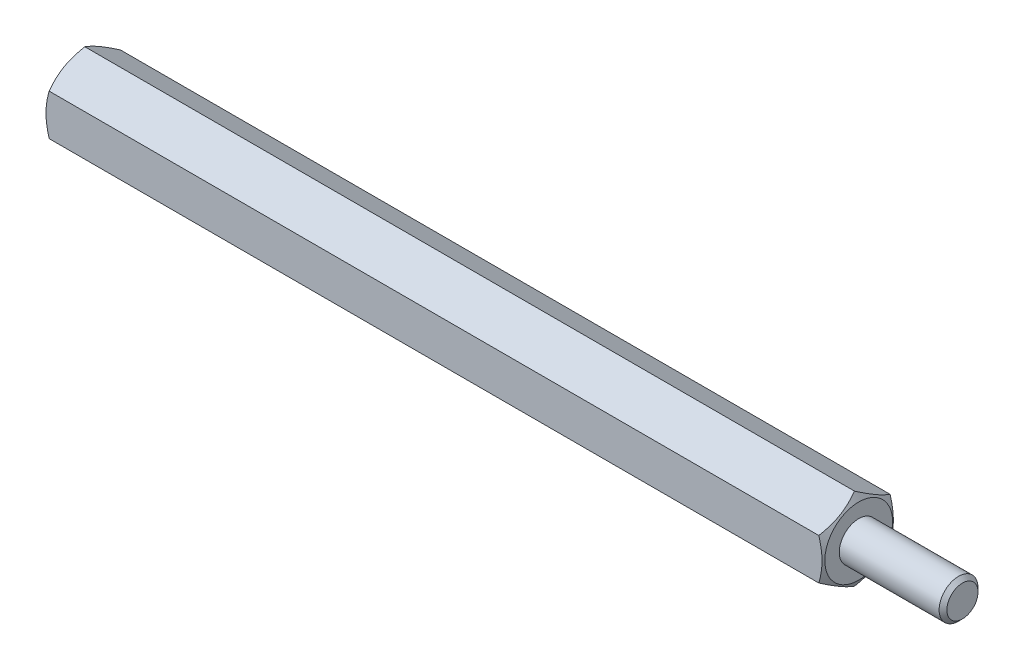
ISO-10303-21;
HEADER;
FILE_DESCRIPTION(('STEP AP214'),'2;1');
FILE_NAME('part.step','',(''),(''),'','','');
FILE_SCHEMA(('AUTOMOTIVE_DESIGN { 1 0 10303 214 1 1 1 1 }'));
ENDSEC;
DATA;
#1=APPLICATION_CONTEXT('core data for automotive mechanical design processes');
#2=APPLICATION_PROTOCOL_DEFINITION('international standard','automotive_design',2000,#1);
#3=PRODUCT_CONTEXT('',#1,'mechanical');
#4=PRODUCT('Part','Part','',(#3));
#5=PRODUCT_RELATED_PRODUCT_CATEGORY('part','',(#4));
#6=PRODUCT_DEFINITION_FORMATION('','',#4);
#7=PRODUCT_DEFINITION_CONTEXT('part definition',#1,'design');
#8=PRODUCT_DEFINITION('design','',#6,#7);
#9=PRODUCT_DEFINITION_SHAPE('','',#8);
#10=(LENGTH_UNIT() NAMED_UNIT(*) SI_UNIT(.MILLI.,.METRE.));
#11=(NAMED_UNIT(*) PLANE_ANGLE_UNIT() SI_UNIT($,.RADIAN.));
#12=(NAMED_UNIT(*) SI_UNIT($,.STERADIAN.) SOLID_ANGLE_UNIT());
#13=UNCERTAINTY_MEASURE_WITH_UNIT(LENGTH_MEASURE(1.E-05),#10,'distance_accuracy_value','');
#14=(GEOMETRIC_REPRESENTATION_CONTEXT(3) GLOBAL_UNCERTAINTY_ASSIGNED_CONTEXT((#13)) GLOBAL_UNIT_ASSIGNED_CONTEXT((#10,
#11,#12)) REPRESENTATION_CONTEXT('',''));
#15=CARTESIAN_POINT('',(0.,0.,0.));
#16=DIRECTION('',(0.,0.,1.));
#17=DIRECTION('',(1.,0.,0.));
#18=AXIS2_PLACEMENT_3D('',#15,#16,#17);
#19=CARTESIAN_POINT('',(60.,0.,0.));
#20=DIRECTION('',(1.,0.,0.));
#21=DIRECTION('',(0.,0.,-1.));
#22=AXIS2_PLACEMENT_3D('',#19,#20,#21);
#23=PLANE('',#22);
#24=CARTESIAN_POINT('',(60.,0.,0.));
#25=DIRECTION('',(1.,0.,0.));
#26=DIRECTION('',(0.,0.,-1.));
#27=AXIS2_PLACEMENT_3D('',#24,#25,#26);
#28=CIRCLE('',#27,1.5);
#29=CARTESIAN_POINT('',(60.,0.,-1.5));
#30=VERTEX_POINT('',#29);
#31=EDGE_CURVE('E120',#30,#30,#28,.T.);
#32=ORIENTED_EDGE('',*,*,#31,.F.);
#33=EDGE_LOOP('',(#32));
#34=FACE_BOUND('',#33,.T.);
#35=CARTESIAN_POINT('',(60.,0.,0.));
#36=DIRECTION('',(1.,0.,0.));
#37=DIRECTION('',(0.,0.,-1.));
#38=AXIS2_PLACEMENT_3D('',#35,#36,#37);
#39=CIRCLE('',#38,2.61250000000001);
#40=CARTESIAN_POINT('',(60.,0.,-2.61250000000001));
#41=VERTEX_POINT('',#40);
#42=EDGE_CURVE('E252',#41,#41,#39,.T.);
#43=ORIENTED_EDGE('',*,*,#42,.T.);
#44=EDGE_LOOP('',(#43));
#45=FACE_BOUND('',#44,.T.);
#46=ADVANCED_FACE('F33',(#34,#45),#23,.T.);
#47=CARTESIAN_POINT('',(68.,0.,0.));
#48=DIRECTION('',(-1.,0.,0.));
#49=DIRECTION('',(0.,0.,1.));
#50=AXIS2_PLACEMENT_3D('',#47,#48,#49);
#51=CYLINDRICAL_SURFACE('',#50,1.5);
#52=CARTESIAN_POINT('',(67.7,0.,0.));
#53=DIRECTION('',(1.,0.,0.));
#54=DIRECTION('',(0.,0.,-1.));
#55=AXIS2_PLACEMENT_3D('',#52,#53,#54);
#56=CIRCLE('',#55,1.5);
#57=CARTESIAN_POINT('',(67.7,0.,-1.5));
#58=VERTEX_POINT('',#57);
#59=EDGE_CURVE('E11',#58,#58,#56,.F.);
#60=ORIENTED_EDGE('',*,*,#59,.T.);
#61=EDGE_LOOP('',(#60));
#62=FACE_BOUND('',#61,.T.);
#63=ORIENTED_EDGE('',*,*,#31,.T.);
#64=EDGE_LOOP('',(#63));
#65=FACE_BOUND('',#64,.T.);
#66=ADVANCED_FACE('F229',(#62,#65),#51,.T.);
#67=CARTESIAN_POINT('',(68.,0.,0.));
#68=DIRECTION('',(1.,0.,0.));
#69=DIRECTION('',(0.,0.,-1.));
#70=AXIS2_PLACEMENT_3D('',#67,#68,#69);
#71=PLANE('',#70);
#72=CARTESIAN_POINT('',(68.,0.,0.));
#73=DIRECTION('',(1.,0.,0.));
#74=DIRECTION('',(0.,0.,-1.));
#75=AXIS2_PLACEMENT_3D('',#72,#73,#74);
#76=CIRCLE('',#75,1.20000000000001);
#77=CARTESIAN_POINT('',(68.,0.,-1.20000000000001));
#78=VERTEX_POINT('',#77);
#79=EDGE_CURVE('E41',#78,#78,#76,.T.);
#80=ORIENTED_EDGE('',*,*,#79,.T.);
#81=EDGE_LOOP('',(#80));
#82=FACE_BOUND('',#81,.T.);
#83=ADVANCED_FACE('F152',(#82),#71,.T.);
#84=CARTESIAN_POINT('',(60.,0.,0.));
#85=DIRECTION('',(-1.,0.,0.));
#86=DIRECTION('',(0.,0.,1.));
#87=AXIS2_PLACEMENT_3D('',#84,#85,#86);
#88=CONICAL_SURFACE('',#87,2.61250000000001,1.0471975511966);
#89=ORIENTED_EDGE('',*,*,#42,.F.);
#90=EDGE_LOOP('',(#89));
#91=FACE_BOUND('',#90,.T.);
#92=CARTESIAN_POINT('',(59.6749275746217,1.58759777021764,-2.7502));
#93=CARTESIAN_POINT('',(59.7152266757372,1.65737010029699,-2.62935077934009));
#94=CARTESIAN_POINT('',(59.7518774353888,1.72774469983534,-2.50745839737736));
#95=CARTESIAN_POINT('',(59.8158521550166,1.86971254687003,-2.2615628732721));
#96=CARTESIAN_POINT('',(59.8431534823119,1.94130831721583,-2.13755536142614));
#97=CARTESIAN_POINT('',(59.8856525926923,2.08361254889599,-1.89107720202405));
#98=CARTESIAN_POINT('',(59.901133219364,2.15429911309864,-1.76864448141258));
#99=CARTESIAN_POINT('',(59.9196149406165,2.29600490065923,-1.52320285763108));
#100=CARTESIAN_POINT('',(59.9226313385238,2.36702360884404,-1.40019484676708));
#101=CARTESIAN_POINT('',(59.9163611925579,2.49972966594897,-1.1703412133892));
#102=CARTESIAN_POINT('',(59.9086141837097,2.56143686540073,-1.06346120874597));
#103=CARTESIAN_POINT('',(59.8840591569221,2.68444923614047,-0.850397532665245));
#104=CARTESIAN_POINT('',(59.8672427483359,2.74575398185008,-0.744214598351106));
#105=CARTESIAN_POINT('',(59.8252024156405,2.86902004703207,-0.530711510606811));
#106=CARTESIAN_POINT('',(59.7998002572992,2.93096576264319,-0.42341838385714));
#107=CARTESIAN_POINT('',(59.7421471121464,3.05393320806134,-0.210432520715945));
#108=CARTESIAN_POINT('',(59.7099096746875,3.11495651365995,-0.104737054973344));
#109=CARTESIAN_POINT('',(59.6749275746217,3.17554195059678,0.000200000000003415));
#110=B_SPLINE_CURVE_WITH_KNOTS('',3,(#92,#93,#94,#95,#96,#97,#98,#99,#100,#101,#102,#103,#104,
#105,#106,#107,#108,#109),.UNSPECIFIED.,.F.,.F.,(4,2,2,2,2,2,2,2,4),(0.,0.435912828725889,
0.872873557116332,1.29901931904672,1.72464171213574,2.09526089052938,2.46622354066374,
2.84541551798557,3.22386274754524),.UNSPECIFIED.);
#111=CARTESIAN_POINT('',(59.6749942449246,1.58771324027148,-2.75));
#112=VERTEX_POINT('',#111);
#113=CARTESIAN_POINT('',(59.6749942449246,3.17542648054294,0.));
#114=VERTEX_POINT('',#113);
#115=EDGE_CURVE('E131',#112,#114,#110,.T.);
#116=ORIENTED_EDGE('',*,*,#115,.T.);
#117=CARTESIAN_POINT('',(59.6749275746217,3.17554195059678,-0.000199999999996035));
#118=CARTESIAN_POINT('',(59.7152266757372,3.10576962051743,0.120649220659911));
#119=CARTESIAN_POINT('',(59.7518774353888,3.03539502097908,0.242541602622638));
#120=CARTESIAN_POINT('',(59.8158521550166,2.89342717394439,0.488437126727896));
#121=CARTESIAN_POINT('',(59.8431534823119,2.82183140359859,0.612444638573859));
#122=CARTESIAN_POINT('',(59.8856525926923,2.67952717191843,0.858922797975947));
#123=CARTESIAN_POINT('',(59.901133219364,2.60884060771577,0.981355518587421));
#124=CARTESIAN_POINT('',(59.9196149406165,2.46713482015519,1.22679714236892));
#125=CARTESIAN_POINT('',(59.9226313385238,2.39611611197038,1.34980515323292));
#126=CARTESIAN_POINT('',(59.9163611925579,2.26341005486544,1.5796587866108));
#127=CARTESIAN_POINT('',(59.9086141837097,2.20170285541369,1.68653879125403));
#128=CARTESIAN_POINT('',(59.8840591569221,2.07869048467395,1.89960246733475));
#129=CARTESIAN_POINT('',(59.8672427483359,2.01738573896434,2.00578540164889));
#130=CARTESIAN_POINT('',(59.8252024156405,1.89411967378235,2.21928848939319));
#131=CARTESIAN_POINT('',(59.7998002572992,1.83217395817123,2.32658161614286));
#132=CARTESIAN_POINT('',(59.7421471121464,1.70920651275308,2.53956747928405));
#133=CARTESIAN_POINT('',(59.7099096746875,1.64818320715446,2.64526294502665));
#134=CARTESIAN_POINT('',(59.6749275746217,1.58759777021764,2.7502));
#135=B_SPLINE_CURVE_WITH_KNOTS('',3,(#117,#118,#119,#120,#121,#122,#123,#124,#125,#126,#127,
#128,#129,#130,#131,#132,#133,#134),.UNSPECIFIED.,.F.,.F.,(4,2,2,2,2,2,2,2,4),(0.,
0.435912828725887,0.872873557116332,1.29901931904672,1.72464171213574,2.09526089052938,
2.46622354066374,2.84541551798557,3.22386274754524),.UNSPECIFIED.);
#136=CARTESIAN_POINT('',(59.6749942449246,1.58771324027147,2.75));
#137=VERTEX_POINT('',#136);
#138=EDGE_CURVE('E139',#114,#137,#135,.T.);
#139=ORIENTED_EDGE('',*,*,#138,.T.);
#140=CARTESIAN_POINT('',(58.5576319326316,-4.30782014241011,2.75));
#141=CARTESIAN_POINT('',(58.6162836095867,-4.18726531654581,2.75));
#142=CARTESIAN_POINT('',(58.6743849240465,-4.06643816910979,2.75));
#143=CARTESIAN_POINT('',(58.7891778669407,-3.8240944166195,2.75));
#144=CARTESIAN_POINT('',(58.8458692806511,-3.70257770996671,2.75));
#145=CARTESIAN_POINT('',(58.9578090560797,-3.458105356063,2.75));
#146=CARTESIAN_POINT('',(59.0130482619427,-3.33514550230565,2.75));
#147=CARTESIAN_POINT('',(59.1213204698911,-3.08826186435015,2.75));
#148=CARTESIAN_POINT('',(59.1743535739049,-2.96433812500113,2.75));
#149=CARTESIAN_POINT('',(59.2792921273943,-2.7113269404381,2.75));
#150=CARTESIAN_POINT('',(59.3311065567683,-2.58220154142924,2.75));
#151=CARTESIAN_POINT('',(59.430916990516,-2.32245648864391,2.75));
#152=CARTESIAN_POINT('',(59.4789125727853,-2.19183667150655,2.75));
#153=CARTESIAN_POINT('',(59.5698579692354,-1.92912498594656,2.75));
#154=CARTESIAN_POINT('',(59.6128175918125,-1.79703654670007,2.75));
#155=CARTESIAN_POINT('',(59.692341778118,-1.53096629694382,2.75));
#156=CARTESIAN_POINT('',(59.7289083094407,-1.39698508274037,2.75));
#157=CARTESIAN_POINT('',(59.7937438460925,-1.12772708047234,2.75));
#158=CARTESIAN_POINT('',(59.8220547897378,-0.992460577616634,2.75));
#159=CARTESIAN_POINT('',(59.8687813176856,-0.720203153927686,2.75));
#160=CARTESIAN_POINT('',(59.8871980675804,-0.583212438163359,2.75));
#161=CARTESIAN_POINT('',(59.9124291314624,-0.309989978008801,2.75));
#162=CARTESIAN_POINT('',(59.9193954911205,-0.17377262999625,2.75));
#163=CARTESIAN_POINT('',(59.9215379629552,0.0987726794769199,2.75));
#164=CARTESIAN_POINT('',(59.9167134971984,0.235100646032144,2.75));
#165=CARTESIAN_POINT('',(59.8989680753535,0.465158037199999,2.75));
#166=CARTESIAN_POINT('',(59.8889841108657,0.559128814459648,2.75));
#167=CARTESIAN_POINT('',(59.8640111201075,0.746408748148826,2.75));
#168=CARTESIAN_POINT('',(59.8490213815566,0.839717808490767,2.75));
#169=CARTESIAN_POINT('',(59.7973222369876,1.11853931619131,2.75));
#170=CARTESIAN_POINT('',(59.7538938441819,1.30282115121641,2.75));
#171=CARTESIAN_POINT('',(59.6782135831305,1.5786792582721,2.75));
#172=CARTESIAN_POINT('',(59.6508277417716,1.67167174830886,2.75));
#173=CARTESIAN_POINT('',(59.5931453490653,1.85669755112827,2.75));
#174=CARTESIAN_POINT('',(59.562850519184,1.94873139590001,2.75));
#175=CARTESIAN_POINT('',(59.4998214739185,2.13194851920639,2.75));
#176=CARTESIAN_POINT('',(59.4670873446708,2.22313182764734,2.75));
#177=CARTESIAN_POINT('',(59.3995759688816,2.40475072200259,2.75));
#178=CARTESIAN_POINT('',(59.3647984472483,2.49518620536279,2.75));
#179=CARTESIAN_POINT('',(59.286074979109,2.69425906745494,2.75));
#180=CARTESIAN_POINT('',(59.2417347386106,2.8027401541903,2.75));
#181=CARTESIAN_POINT('',(59.1510337491748,3.01885617108242,2.75));
#182=CARTESIAN_POINT('',(59.1046729095401,3.12649106300008,2.75));
#183=CARTESIAN_POINT('',(58.9631220023641,3.44835421203613,2.75));
#184=CARTESIAN_POINT('',(58.865478930226,3.66150285378819,2.75));
#185=CARTESIAN_POINT('',(58.6657085844919,4.08582350126589,2.75));
#186=CARTESIAN_POINT('',(58.5635786539451,4.29699424346804,2.75));
#187=CARTESIAN_POINT('',(58.3561807980291,4.71779425640232,2.75));
#188=CARTESIAN_POINT('',(58.2509127618966,4.92742347239814,2.75));
#189=CARTESIAN_POINT('',(58.037845903081,5.34602646409934,2.75));
#190=CARTESIAN_POINT('',(57.9300415771346,5.55499742988841,2.75));
#191=CARTESIAN_POINT('',(57.7127213552635,5.97205161125949,2.75));
#192=CARTESIAN_POINT('',(57.6032054225523,6.18013480763858,2.75));
#193=CARTESIAN_POINT('',(57.2728160121337,6.80319050465919,2.75));
#194=CARTESIAN_POINT('',(57.0500134395911,7.21713914846339,2.75));
#195=CARTESIAN_POINT('',(56.6349320787507,7.98131294129822,2.75));
#196=CARTESIAN_POINT('',(56.443091202704,8.33177707266852,2.75));
#197=CARTESIAN_POINT('',(56.0577699675954,9.03185646098386,2.75));
#198=CARTESIAN_POINT('',(55.8642894185863,9.38147161337288,2.75));
#199=CARTESIAN_POINT('',(55.4770176449484,10.0785196333477,2.75));
#200=CARTESIAN_POINT('',(55.2832315222264,10.425955339249,2.75));
#201=CARTESIAN_POINT('',(54.8948017372515,11.1202888046247,2.75));
#202=CARTESIAN_POINT('',(54.7001581879707,11.4671866272798,2.75));
#203=CARTESIAN_POINT('',(54.5052089419493,11.8139117951099,2.75));
#204=B_SPLINE_CURVE_WITH_KNOTS('',3,(#140,#141,#142,#143,#144,#145,#146,#147,#148,#149,#150,
#151,#152,#153,#154,#155,#156,#157,#158,#159,#160,#161,#162,#163,#164,#165,#166,#167,#168,#169,
#170,#171,#172,#173,#174,#175,#176,#177,#178,#179,#180,#181,#182,#183,#184,#185,#186,#187,#188,
#189,#190,#191,#192,#193,#194,#195,#196,#197,#198,#199,#200,#201,#202,#203),.UNSPECIFIED.,.F.,
.F.,(4,2,2,2,2,2,2,2,2,2,2,2,2,2,2,2,2,2,2,2,2,2,2,2,2,2,2,2,2,2,2,4),(0.,0.402200406174205,
0.804461695776017,1.20883826557492,1.61319613116904,2.03054962807288,2.44794919196405,
2.86452179433192,3.28096596207104,3.69525619374117,4.10949760895259,4.51819266601271,
4.92690775587314,5.21027047572885,5.49367353296155,6.06085418548304,6.35165161864581,
6.64227801348786,6.93289415059065,7.22354950196185,7.57510236122624,7.92667101670863,
8.62993150186773,9.33361419796499,10.0373217608381,10.7427306430188,11.4481547069671,
12.8584292219797,14.0570297519007,15.255771084781,16.4492444189717,17.6425649463424),.UNSPECIFIED.);
#205=CARTESIAN_POINT('',(59.6749942449246,-1.58771324027147,2.75));
#206=VERTEX_POINT('',#205);
#207=EDGE_CURVE('E179',#137,#206,#204,.F.);
#208=ORIENTED_EDGE('',*,*,#207,.T.);
#209=CARTESIAN_POINT('',(59.6749275746217,-1.58759777021763,2.7502));
#210=CARTESIAN_POINT('',(59.7152266757372,-1.65737010029699,2.62935077934009));
#211=CARTESIAN_POINT('',(59.7518774353888,-1.72774469983533,2.50745839737736));
#212=CARTESIAN_POINT('',(59.8158521550166,-1.86971254687003,2.26156287327211));
#213=CARTESIAN_POINT('',(59.8431534823119,-1.94130831721583,2.13755536142614));
#214=CARTESIAN_POINT('',(59.8856525926923,-2.08361254889599,1.89107720202405));
#215=CARTESIAN_POINT('',(59.901133219364,-2.15429911309864,1.76864448141258));
#216=CARTESIAN_POINT('',(59.9196149406165,-2.29600490065923,1.52320285763108));
#217=CARTESIAN_POINT('',(59.9226313385238,-2.36702360884404,1.40019484676709));
#218=CARTESIAN_POINT('',(59.9163611925579,-2.49972966594897,1.1703412133892));
#219=CARTESIAN_POINT('',(59.9086141837097,-2.56143686540073,1.06346120874597));
#220=CARTESIAN_POINT('',(59.8840591569221,-2.68444923614047,0.850397532665246));
#221=CARTESIAN_POINT('',(59.8672427483359,-2.74575398185008,0.744214598351106));
#222=CARTESIAN_POINT('',(59.8252024156405,-2.86902004703207,0.530711510606811));
#223=CARTESIAN_POINT('',(59.7998002572992,-2.93096576264319,0.423418383857139));
#224=CARTESIAN_POINT('',(59.7421471121464,-3.05393320806134,0.210432520715943));
#225=CARTESIAN_POINT('',(59.7099096746875,-3.11495651365995,0.104737054973343));
#226=CARTESIAN_POINT('',(59.6749275746217,-3.17554195059678,-0.000200000000004998));
#227=B_SPLINE_CURVE_WITH_KNOTS('',3,(#209,#210,#211,#212,#213,#214,#215,#216,#217,#218,#219,
#220,#221,#222,#223,#224,#225,#226),.UNSPECIFIED.,.F.,.F.,(4,2,2,2,2,2,2,2,4),(0.,
0.435912828725889,0.872873557116333,1.29901931904672,1.72464171213574,2.09526089052938,
2.46622354066375,2.84541551798558,3.22386274754525),.UNSPECIFIED.);
#228=CARTESIAN_POINT('',(59.6749942449246,-3.17542648054294,0.));
#229=VERTEX_POINT('',#228);
#230=EDGE_CURVE('E174',#206,#229,#227,.T.);
#231=ORIENTED_EDGE('',*,*,#230,.T.);
#232=CARTESIAN_POINT('',(59.6749275746217,-3.17554195059678,0.000199999999994932));
#233=CARTESIAN_POINT('',(59.7152266757372,-3.10576962051743,-0.120649220659912));
#234=CARTESIAN_POINT('',(59.7518774353888,-3.03539502097908,-0.242541602622639));
#235=CARTESIAN_POINT('',(59.8158521550166,-2.89342717394439,-0.488437126727897));
#236=CARTESIAN_POINT('',(59.8431534823119,-2.82183140359859,-0.61244463857386));
#237=CARTESIAN_POINT('',(59.8856525926923,-2.67952717191843,-0.858922797975949));
#238=CARTESIAN_POINT('',(59.901133219364,-2.60884060771577,-0.981355518587424));
#239=CARTESIAN_POINT('',(59.9196149406165,-2.46713482015519,-1.22679714236892));
#240=CARTESIAN_POINT('',(59.9226313385238,-2.39611611197038,-1.34980515323292));
#241=CARTESIAN_POINT('',(59.9163611925579,-2.26341005486544,-1.5796587866108));
#242=CARTESIAN_POINT('',(59.9086141837097,-2.20170285541369,-1.68653879125403));
#243=CARTESIAN_POINT('',(59.8840591569221,-2.07869048467395,-1.89960246733475));
#244=CARTESIAN_POINT('',(59.8672427483359,-2.01738573896434,-2.00578540164889));
#245=CARTESIAN_POINT('',(59.8252024156405,-1.89411967378235,-2.21928848939319));
#246=CARTESIAN_POINT('',(59.7998002572992,-1.83217395817123,-2.32658161614286));
#247=CARTESIAN_POINT('',(59.7421471121465,-1.70920651275308,-2.53956747928405));
#248=CARTESIAN_POINT('',(59.7099096746875,-1.64818320715447,-2.64526294502665));
#249=CARTESIAN_POINT('',(59.6749275746217,-1.58759777021764,-2.7502));
#250=B_SPLINE_CURVE_WITH_KNOTS('',3,(#232,#233,#234,#235,#236,#237,#238,#239,#240,#241,#242,
#243,#244,#245,#246,#247,#248,#249),.UNSPECIFIED.,.F.,.F.,(4,2,2,2,2,2,2,2,4),(0.,
0.435912828725887,0.872873557116332,1.29901931904672,1.72464171213574,2.09526089052937,
2.46622354066374,2.84541551798557,3.22386274754523),.UNSPECIFIED.);
#251=CARTESIAN_POINT('',(59.6749942449246,-1.58771324027148,-2.75));
#252=VERTEX_POINT('',#251);
#253=EDGE_CURVE('E48',#229,#252,#250,.T.);
#254=ORIENTED_EDGE('',*,*,#253,.T.);
#255=CARTESIAN_POINT('',(58.5576319321002,-4.30782014350212,-2.75));
#256=CARTESIAN_POINT('',(58.6162836090775,-4.18726531760099,-2.75));
#257=CARTESIAN_POINT('',(58.6743849235596,-4.06643817012811,-2.75));
#258=CARTESIAN_POINT('',(58.789177866498,-3.824094417564,-2.75));
#259=CARTESIAN_POINT('',(58.8458692802305,-3.70257771087424,-2.75));
#260=CARTESIAN_POINT('',(58.9578090557033,-3.45810535689603,-2.75));
#261=CARTESIAN_POINT('',(59.0130482615885,-3.33514550310114,-2.75));
#262=CARTESIAN_POINT('',(59.1213204695807,-3.08826186507032,-2.75));
#263=CARTESIAN_POINT('',(59.1743535736162,-2.9643381256835,-2.75));
#264=CARTESIAN_POINT('',(59.2792921271496,-2.71132694104215,-2.75));
#265=CARTESIAN_POINT('',(59.3311065565458,-2.58220154199273,-2.75));
#266=CARTESIAN_POINT('',(59.4309169903368,-2.32245648912563,-2.75));
#267=CARTESIAN_POINT('',(59.4789125726271,-2.19183667194707,-2.75));
#268=CARTESIAN_POINT('',(59.5698579691173,-1.9291249863039,-2.75));
#269=CARTESIAN_POINT('',(59.6128175917135,-1.79703654701545,-2.75));
#270=CARTESIAN_POINT('',(59.692341778054,-1.53096629717411,-2.75));
#271=CARTESIAN_POINT('',(59.7289083093926,-1.39698508292755,-2.75));
#272=CARTESIAN_POINT('',(59.7937438460766,-1.12772708055108,-2.75));
#273=CARTESIAN_POINT('',(59.8220547897369,-0.992460577629732,-2.75));
#274=CARTESIAN_POINT('',(59.8687813177048,-0.720203153807921,-2.75));
#275=CARTESIAN_POINT('',(59.8871980676048,-0.583212437976371,-2.75));
#276=CARTESIAN_POINT('',(59.912429131485,-0.309989977688434,-2.75));
#277=CARTESIAN_POINT('',(59.9193954911365,-0.17377262960974,-2.75));
#278=CARTESIAN_POINT('',(59.9215379629464,0.0987726799947081,-2.75));
#279=CARTESIAN_POINT('',(59.9167134971714,0.235100646615067,-2.75));
#280=CARTESIAN_POINT('',(59.8989680752897,0.465158037864658,-2.75));
#281=CARTESIAN_POINT('',(59.8889841107874,0.559128815141646,-2.75));
#282=CARTESIAN_POINT('',(59.8640111199994,0.746408748864727,-2.75));
#283=CARTESIAN_POINT('',(59.8490213814332,0.839717809223231,-2.75));
#284=CARTESIAN_POINT('',(59.7973222368179,1.1185393169726,-2.75));
#285=CARTESIAN_POINT('',(59.7538938439809,1.30282115202896,-2.75));
#286=CARTESIAN_POINT('',(59.6782135828835,1.57867925913149,-2.75));
#287=CARTESIAN_POINT('',(59.6508277415091,1.67167174918423,-2.75));
#288=CARTESIAN_POINT('',(59.5931453487722,1.85669755203541,-2.75));
#289=CARTESIAN_POINT('',(59.5628505188759,1.94873139682294,-2.75));
#290=CARTESIAN_POINT('',(59.4998214735808,2.13194852016076,-2.75));
#291=CARTESIAN_POINT('',(59.4670873443186,2.22313182861738,-2.75));
#292=CARTESIAN_POINT('',(59.399575968501,2.40475072300398,-2.75));
#293=CARTESIAN_POINT('',(59.3647984468537,2.49518620637986,-2.75));
#294=CARTESIAN_POINT('',(59.2860749786937,2.69425906848207,-2.75));
#295=CARTESIAN_POINT('',(59.2417347381892,2.80274015521204,-2.74999999999999));
#296=CARTESIAN_POINT('',(59.1510337487429,3.01885617209384,-2.74999999999999));
#297=CARTESIAN_POINT('',(59.1046729091036,3.12649106400656,-2.74999999999999));
#298=CARTESIAN_POINT('',(58.9631220019155,3.44835421302832,-2.74999999999999));
#299=CARTESIAN_POINT('',(58.8654789297715,3.66150285477161,-2.74999999999999));
#300=CARTESIAN_POINT('',(58.6657085840283,4.08582350223269,-2.74999999999999));
#301=CARTESIAN_POINT('',(58.5635786534784,4.29699424442699,-2.74999999999999));
#302=CARTESIAN_POINT('',(58.3561807975579,4.71779425734632,-2.74999999999999));
#303=CARTESIAN_POINT('',(58.2509127614241,4.92742347333506,-2.74999999999999));
#304=CARTESIAN_POINT('',(58.0378459026071,5.34602646502203,-2.74999999999999));
#305=CARTESIAN_POINT('',(57.9300415766607,5.55499743080398,-2.74999999999999));
#306=CARTESIAN_POINT('',(57.7127213547904,5.97205161216119,-2.74999999999999));
#307=CARTESIAN_POINT('',(57.6032054220802,6.18013480853354,-2.74999999999999));
#308=CARTESIAN_POINT('',(57.2728160116647,6.80319050553456,-2.74999999999999));
#309=CARTESIAN_POINT('',(57.0500134391252,7.21713914932633,-2.74999999999999));
#310=CARTESIAN_POINT('',(56.6349320782842,7.98131294215254,-2.74999999999999));
#311=CARTESIAN_POINT('',(56.4430912022335,8.33177707352652,-2.74999999999999));
#312=CARTESIAN_POINT('',(56.0577699671173,9.03185646184938,-2.74999999999999));
#313=CARTESIAN_POINT('',(55.8642894181045,9.38147161424224,-2.74999999999999));
#314=CARTESIAN_POINT('',(55.4770176444589,10.0785196342265,-2.74999999999999));
#315=CARTESIAN_POINT('',(55.2832315217327,10.4259553401334,-2.74999999999999));
#316=CARTESIAN_POINT('',(54.8948017367494,11.1202888055205,-2.74999999999999));
#317=CARTESIAN_POINT('',(54.7001581874645,11.4671866281813,-2.74999999999999));
#318=CARTESIAN_POINT('',(54.5052089414391,11.8139117960172,-2.74999999999999));
#319=B_SPLINE_CURVE_WITH_KNOTS('',3,(#255,#256,#257,#258,#259,#260,#261,#262,#263,#264,#265,
#266,#267,#268,#269,#270,#271,#272,#273,#274,#275,#276,#277,#278,#279,#280,#281,#282,#283,#284,
#285,#286,#287,#288,#289,#290,#291,#292,#293,#294,#295,#296,#297,#298,#299,#300,#301,#302,#303,
#304,#305,#306,#307,#308,#309,#310,#311,#312,#313,#314,#315,#316,#317,#318),.UNSPECIFIED.,.F.,
.F.,(4,2,2,2,2,2,2,2,2,2,2,2,2,2,2,2,2,2,2,2,2,2,2,2,2,2,2,2,2,2,2,4),(0.,0.402200406302725,
0.80446169603307,1.20883826596186,1.61319613168587,2.03054962872746,2.44794919275641,
2.86452179526161,3.28096596313794,3.69525619500961,4.10949761042227,4.51819266767878,
4.92690775773571,5.21027047764774,5.49367353493676,6.06085418757123,6.35165162079318,
6.64227801569432,6.93289415285606,7.22354950428625,7.57510236354253,7.9266710190168,
8.62993150415945,9.33361420023962,10.0373217630956,10.7427306452573,11.4481547091865,
12.8584292241618,14.0570297540983,15.2557710869939,16.4492444212054,17.6425649485972),.UNSPECIFIED.);
#320=EDGE_CURVE('E104',#252,#112,#319,.T.);
#321=ORIENTED_EDGE('',*,*,#320,.T.);
#322=EDGE_LOOP('',(#116,#139,#208,#231,#254,#321));
#323=FACE_BOUND('',#322,.T.);
#324=ADVANCED_FACE('F147',(#91,#323),#88,.T.);
#325=CARTESIAN_POINT('',(60.,-1.58771324027148,-2.75));
#326=DIRECTION('',(0.,0.,1.));
#327=DIRECTION('',(0.,-1.,0.));
#328=AXIS2_PLACEMENT_3D('',#325,#326,#327);
#329=PLANE('',#328);
#330=DIRECTION('',(-1.,0.,0.));
#331=VECTOR('',#330,1.);
#332=CARTESIAN_POINT('',(60.,-1.58771324027148,-2.75));
#333=LINE('',#332,#331);
#334=CARTESIAN_POINT('',(0.325005755075304,-1.58771324027167,-2.75));
#335=VERTEX_POINT('',#334);
#336=EDGE_CURVE('E98',#252,#335,#333,.T.);
#337=ORIENTED_EDGE('',*,*,#336,.T.);
#338=CARTESIAN_POINT('',(1.44236806789984,-4.30782014350212,-2.75));
#339=CARTESIAN_POINT('',(1.38371639092254,-4.18726531760099,-2.75));
#340=CARTESIAN_POINT('',(1.32561507644045,-4.06643817012812,-2.75));
#341=CARTESIAN_POINT('',(1.21082213350203,-3.824094417564,-2.75));
#342=CARTESIAN_POINT('',(1.15413071976949,-3.70257771087424,-2.75));
#343=CARTESIAN_POINT('',(1.04219094429671,-3.45810535689603,-2.75));
#344=CARTESIAN_POINT('',(0.98695173841154,-3.33514550310114,-2.75));
#345=CARTESIAN_POINT('',(0.878679530419349,-3.08826186507032,-2.75));
#346=CARTESIAN_POINT('',(0.825646426383825,-2.9643381256835,-2.75));
#347=CARTESIAN_POINT('',(0.720707872850375,-2.71132694104215,-2.75));
#348=CARTESIAN_POINT('',(0.668893443454169,-2.58220154199273,-2.75));
#349=CARTESIAN_POINT('',(0.56908300966316,-2.32245648912563,-2.75));
#350=CARTESIAN_POINT('',(0.521087427372889,-2.19183667194707,-2.75));
#351=CARTESIAN_POINT('',(0.430142030882725,-1.9291249863039,-2.75));
#352=CARTESIAN_POINT('',(0.387182408286516,-1.79703654701544,-2.75));
#353=CARTESIAN_POINT('',(0.307658221946016,-1.53096629717411,-2.75));
#354=CARTESIAN_POINT('',(0.271091690607389,-1.39698508292755,-2.75));
#355=CARTESIAN_POINT('',(0.206256153923405,-1.12772708055107,-2.75));
#356=CARTESIAN_POINT('',(0.17794521026309,-0.992460577629727,-2.75));
#357=CARTESIAN_POINT('',(0.131218682295206,-0.720203153807916,-2.75));
#358=CARTESIAN_POINT('',(0.11280193239521,-0.583212437976367,-2.75));
#359=CARTESIAN_POINT('',(0.087570868514987,-0.309989977688431,-2.75));
#360=CARTESIAN_POINT('',(0.0806045088634958,-0.173772629609737,-2.75));
#361=CARTESIAN_POINT('',(0.078462037053641,0.0987726799947109,-2.75));
#362=CARTESIAN_POINT('',(0.0832865028286562,0.23510064661507,-2.75));
#363=CARTESIAN_POINT('',(0.101031924710265,0.465158037864661,-2.75));
#364=CARTESIAN_POINT('',(0.111015889212559,0.559128815141647,-2.75));
#365=CARTESIAN_POINT('',(0.135988880000603,0.746408748864728,-2.75));
#366=CARTESIAN_POINT('',(0.150978618566838,0.839717809223232,-2.75));
#367=CARTESIAN_POINT('',(0.20267776318206,1.1185393169726,-2.75));
#368=CARTESIAN_POINT('',(0.246106156019073,1.30282115202896,-2.75));
#369=CARTESIAN_POINT('',(0.321786417116547,1.57867925913149,-2.75));
#370=CARTESIAN_POINT('',(0.349172258490935,1.67167174918423,-2.75));
#371=CARTESIAN_POINT('',(0.406854651227838,1.85669755203541,-2.75));
#372=CARTESIAN_POINT('',(0.437149481124149,1.94873139682294,-2.75));
#373=CARTESIAN_POINT('',(0.500178526419205,2.13194852016076,-2.75));
#374=CARTESIAN_POINT('',(0.532912655681421,2.22313182861738,-2.75));
#375=CARTESIAN_POINT('',(0.600424031499047,2.40475072300398,-2.75));
#376=CARTESIAN_POINT('',(0.635201553146344,2.49518620637986,-2.75));
#377=CARTESIAN_POINT('',(0.713925021306319,2.69425906848207,-2.75));
#378=CARTESIAN_POINT('',(0.75826526181078,2.80274015521204,-2.74999999999999));
#379=CARTESIAN_POINT('',(0.848966251257138,3.01885617209384,-2.74999999999999));
#380=CARTESIAN_POINT('',(0.895327090896407,3.12649106400656,-2.74999999999999));
#381=CARTESIAN_POINT('',(1.03687799808455,3.44835421302832,-2.74999999999999));
#382=CARTESIAN_POINT('',(1.13452107022851,3.66150285477161,-2.74999999999999));
#383=CARTESIAN_POINT('',(1.33429141597171,4.08582350223269,-2.74999999999999));
#384=CARTESIAN_POINT('',(1.43642134652157,4.29699424442699,-2.74999999999999));
#385=CARTESIAN_POINT('',(1.64381920244215,4.71779425734633,-2.74999999999999));
#386=CARTESIAN_POINT('',(1.74908723857596,4.92742347333506,-2.74999999999999));
#387=CARTESIAN_POINT('',(1.96215409739296,5.34602646502203,-2.74999999999999));
#388=CARTESIAN_POINT('',(2.06995842333932,5.55499743080399,-2.74999999999999));
#389=CARTESIAN_POINT('',(2.28727864520958,5.97205161216119,-2.74999999999999));
#390=CARTESIAN_POINT('',(2.39679457791986,6.18013480853355,-2.74999999999999));
#391=CARTESIAN_POINT('',(2.7271839883353,6.80319050553457,-2.74999999999999));
#392=CARTESIAN_POINT('',(2.94998656087477,7.21713914932633,-2.74999999999999));
#393=CARTESIAN_POINT('',(3.36506792171577,7.98131294215254,-2.74999999999999));
#394=CARTESIAN_POINT('',(3.55690879776654,8.33177707352653,-2.74999999999999));
#395=CARTESIAN_POINT('',(3.94223003288275,9.03185646184938,-2.74999999999999));
#396=CARTESIAN_POINT('',(4.13571058189547,9.38147161424225,-2.74999999999999));
#397=CARTESIAN_POINT('',(4.52298235554117,10.0785196342265,-2.74999999999999));
#398=CARTESIAN_POINT('',(4.71676847826737,10.4259553401334,-2.74999999999999));
#399=CARTESIAN_POINT('',(5.1051982632506,11.1202888055205,-2.74999999999999));
#400=CARTESIAN_POINT('',(5.29984181253548,11.4671866281813,-2.74999999999999));
#401=CARTESIAN_POINT('',(5.49479105856088,11.8139117960173,-2.74999999999999));
#402=B_SPLINE_CURVE_WITH_KNOTS('',3,(#338,#339,#340,#341,#342,#343,#344,#345,#346,#347,#348,
#349,#350,#351,#352,#353,#354,#355,#356,#357,#358,#359,#360,#361,#362,#363,#364,#365,#366,#367,
#368,#369,#370,#371,#372,#373,#374,#375,#376,#377,#378,#379,#380,#381,#382,#383,#384,#385,#386,
#387,#388,#389,#390,#391,#392,#393,#394,#395,#396,#397,#398,#399,#400,#401),.UNSPECIFIED.,.F.,
.F.,(4,2,2,2,2,2,2,2,2,2,2,2,2,2,2,2,2,2,2,2,2,2,2,2,2,2,2,2,2,2,2,4),(0.,0.402200406302722,
0.804461696033069,1.20883826596187,1.61319613168587,2.03054962872746,2.44794919275641,
2.86452179526161,3.28096596313794,3.69525619500962,4.10949761042228,4.51819266767879,
4.92690775773572,5.21027047764774,5.49367353493677,6.06085418757123,6.35165162079318,
6.64227801569432,6.93289415285606,7.22354950428625,7.57510236354254,7.9266710190168,
8.62993150415945,9.33361420023962,10.0373217630956,10.7427306452573,11.4481547091865,
12.8584292241618,14.0570297540983,15.2557710869939,16.4492444212055,17.6425649485972),.UNSPECIFIED.);
#403=CARTESIAN_POINT('',(0.325005755075435,1.58771324027148,-2.75));
#404=VERTEX_POINT('',#403);
#405=EDGE_CURVE('E83',#335,#404,#402,.T.);
#406=ORIENTED_EDGE('',*,*,#405,.T.);
#407=DIRECTION('',(-1.,0.,0.));
#408=VECTOR('',#407,1.);
#409=CARTESIAN_POINT('',(60.,1.58771324027148,-2.75));
#410=LINE('',#409,#408);
#411=EDGE_CURVE('E105',#112,#404,#410,.T.);
#412=ORIENTED_EDGE('',*,*,#411,.F.);
#413=ORIENTED_EDGE('',*,*,#320,.F.);
#414=EDGE_LOOP('',(#337,#406,#412,#413));
#415=FACE_BOUND('',#414,.T.);
#416=ADVANCED_FACE('F103',(#415),#329,.F.);
#417=CARTESIAN_POINT('',(60.,-3.17542648054294,0.));
#418=DIRECTION('',(0.,0.866025403784438,0.5));
#419=DIRECTION('',(0.,-0.5,0.866025403784439));
#420=AXIS2_PLACEMENT_3D('',#417,#418,#419);
#421=PLANE('',#420);
#422=DIRECTION('',(-1.,0.,0.));
#423=VECTOR('',#422,1.);
#424=CARTESIAN_POINT('',(60.,-3.17542648054294,0.));
#425=LINE('',#424,#423);
#426=CARTESIAN_POINT('',(0.325005755075438,-3.17542648054294,0.));
#427=VERTEX_POINT('',#426);
#428=EDGE_CURVE('E100',#229,#427,#425,.T.);
#429=ORIENTED_EDGE('',*,*,#428,.T.);
#430=CARTESIAN_POINT('',(0.325072425378336,-3.17554195059678,0.000199999999995148));
#431=CARTESIAN_POINT('',(0.284773324262838,-3.10576962051743,-0.120649220659911));
#432=CARTESIAN_POINT('',(0.248122564611237,-3.03539502097908,-0.242541602622639));
#433=CARTESIAN_POINT('',(0.184147844983376,-2.89342717394439,-0.488437126727898));
#434=CARTESIAN_POINT('',(0.156846517688073,-2.82183140359859,-0.612444638573861));
#435=CARTESIAN_POINT('',(0.114347407307692,-2.67952717191843,-0.85892279797595));
#436=CARTESIAN_POINT('',(0.0988667806360332,-2.60884060771577,-0.981355518587423));
#437=CARTESIAN_POINT('',(0.080385059383516,-2.46713482015519,-1.22679714236892));
#438=CARTESIAN_POINT('',(0.0773686614761753,-2.39611611197038,-1.34980515323292));
#439=CARTESIAN_POINT('',(0.0836388074421225,-2.26341005486544,-1.5796587866108));
#440=CARTESIAN_POINT('',(0.0913858162902783,-2.20170285541369,-1.68653879125403));
#441=CARTESIAN_POINT('',(0.115940843077931,-2.07869048467395,-1.89960246733475));
#442=CARTESIAN_POINT('',(0.132757251664146,-2.01738573896434,-2.00578540164889));
#443=CARTESIAN_POINT('',(0.174797584359532,-1.89411967378235,-2.21928848939318));
#444=CARTESIAN_POINT('',(0.200199742700806,-1.83217395817123,-2.32658161614285));
#445=CARTESIAN_POINT('',(0.257852887853557,-1.70920651275308,-2.53956747928405));
#446=CARTESIAN_POINT('',(0.290090325312557,-1.64818320715447,-2.64526294502665));
#447=CARTESIAN_POINT('',(0.325072425378334,-1.58759777021764,-2.7502));
#448=B_SPLINE_CURVE_WITH_KNOTS('',3,(#430,#431,#432,#433,#434,#435,#436,#437,#438,#439,#440,
#441,#442,#443,#444,#445,#446,#447),.UNSPECIFIED.,.F.,.F.,(4,2,2,2,2,2,2,2,4),(0.,
0.435912828725889,0.872873557116333,1.29901931904672,1.72464171213574,2.09526089052937,
2.46622354066374,2.84541551798557,3.22386274754523),.UNSPECIFIED.);
#449=EDGE_CURVE('E86',#427,#335,#448,.T.);
#450=ORIENTED_EDGE('',*,*,#449,.T.);
#451=ORIENTED_EDGE('',*,*,#336,.F.);
#452=ORIENTED_EDGE('',*,*,#253,.F.);
#453=EDGE_LOOP('',(#429,#450,#451,#452));
#454=FACE_BOUND('',#453,.T.);
#455=ADVANCED_FACE('F97',(#454),#421,.F.);
#456=CARTESIAN_POINT('',(60.,-1.58771324027147,2.75));
#457=DIRECTION('',(0.,0.866025403784439,-0.5));
#458=DIRECTION('',(0.,0.5,0.866025403784439));
#459=AXIS2_PLACEMENT_3D('',#456,#457,#458);
#460=PLANE('',#459);
#461=DIRECTION('',(-1.,0.,0.));
#462=VECTOR('',#461,1.);
#463=CARTESIAN_POINT('',(60.,-1.58771324027147,2.75));
#464=LINE('',#463,#462);
#465=CARTESIAN_POINT('',(0.325005755075436,-1.58771324027147,2.75));
#466=VERTEX_POINT('',#465);
#467=EDGE_CURVE('E107',#206,#466,#464,.T.);
#468=ORIENTED_EDGE('',*,*,#467,.T.);
#469=CARTESIAN_POINT('',(0.325072425378334,-1.58759777021763,2.7502));
#470=CARTESIAN_POINT('',(0.284773324262837,-1.65737010029699,2.62935077934009));
#471=CARTESIAN_POINT('',(0.248122564611236,-1.72774469983533,2.50745839737737));
#472=CARTESIAN_POINT('',(0.184147844983374,-1.86971254687003,2.26156287327211));
#473=CARTESIAN_POINT('',(0.156846517688071,-1.94130831721583,2.13755536142614));
#474=CARTESIAN_POINT('',(0.11434740730769,-2.08361254889599,1.89107720202405));
#475=CARTESIAN_POINT('',(0.0988667806360311,-2.15429911309864,1.76864448141258));
#476=CARTESIAN_POINT('',(0.0803850593835137,-2.29600490065923,1.52320285763108));
#477=CARTESIAN_POINT('',(0.0773686614761731,-2.36702360884404,1.40019484676709));
#478=CARTESIAN_POINT('',(0.0836388074421203,-2.49972966594897,1.1703412133892));
#479=CARTESIAN_POINT('',(0.0913858162902761,-2.56143686540073,1.06346120874598));
#480=CARTESIAN_POINT('',(0.115940843077929,-2.68444923614047,0.850397532665247));
#481=CARTESIAN_POINT('',(0.132757251664144,-2.74575398185008,0.744214598351107));
#482=CARTESIAN_POINT('',(0.174797584359531,-2.86902004703207,0.530711510606812));
#483=CARTESIAN_POINT('',(0.200199742700805,-2.93096576264319,0.423418383857141));
#484=CARTESIAN_POINT('',(0.257852887853557,-3.05393320806134,0.210432520715944));
#485=CARTESIAN_POINT('',(0.290090325312558,-3.11495651365995,0.104737054973343));
#486=CARTESIAN_POINT('',(0.325072425378336,-3.17554195059678,-0.00020000000000501));
#487=B_SPLINE_CURVE_WITH_KNOTS('',3,(#469,#470,#471,#472,#473,#474,#475,#476,#477,#478,#479,
#480,#481,#482,#483,#484,#485,#486),.UNSPECIFIED.,.F.,.F.,(4,2,2,2,2,2,2,2,4),(0.,
0.435912828725888,0.872873557116333,1.29901931904672,1.72464171213574,2.09526089052938,
2.46622354066375,2.84541551798558,3.22386274754525),.UNSPECIFIED.);
#488=EDGE_CURVE('E101',#466,#427,#487,.T.);
#489=ORIENTED_EDGE('',*,*,#488,.T.);
#490=ORIENTED_EDGE('',*,*,#428,.F.);
#491=ORIENTED_EDGE('',*,*,#230,.F.);
#492=EDGE_LOOP('',(#468,#489,#490,#491));
#493=FACE_BOUND('',#492,.T.);
#494=ADVANCED_FACE('F188',(#493),#460,.F.);
#495=CARTESIAN_POINT('',(60.,1.58771324027147,2.75));
#496=DIRECTION('',(0.,0.,-1.));
#497=DIRECTION('',(-1.,0.,0.));
#498=AXIS2_PLACEMENT_3D('',#495,#496,#497);
#499=PLANE('',#498);
#500=DIRECTION('',(-1.,0.,0.));
#501=VECTOR('',#500,1.);
#502=CARTESIAN_POINT('',(60.,1.58771324027147,2.75));
#503=LINE('',#502,#501);
#504=CARTESIAN_POINT('',(0.325005755075436,1.58771324027147,2.75));
#505=VERTEX_POINT('',#504);
#506=EDGE_CURVE('E115',#137,#505,#503,.T.);
#507=ORIENTED_EDGE('',*,*,#506,.T.);
#508=CARTESIAN_POINT('',(1.44236806736841,-4.30782014241011,2.75));
#509=CARTESIAN_POINT('',(1.38371639041334,-4.18726531654581,2.75));
#510=CARTESIAN_POINT('',(1.32561507595345,-4.06643816910979,2.75));
#511=CARTESIAN_POINT('',(1.21082213305934,-3.8240944166195,2.75));
#512=CARTESIAN_POINT('',(1.1541307193489,-3.7025777099667,2.75));
#513=CARTESIAN_POINT('',(1.04219094392033,-3.458105356063,2.75));
#514=CARTESIAN_POINT('',(0.986951738057271,-3.33514550230565,2.75));
#515=CARTESIAN_POINT('',(0.878679530108924,-3.08826186435015,2.75));
#516=CARTESIAN_POINT('',(0.825646426095137,-2.96433812500113,2.75));
#517=CARTESIAN_POINT('',(0.720707872605697,-2.7113269404381,2.75));
#518=CARTESIAN_POINT('',(0.668893443231718,-2.58220154142924,2.75));
#519=CARTESIAN_POINT('',(0.569083009483976,-2.32245648864391,2.75));
#520=CARTESIAN_POINT('',(0.521087427214747,-2.19183667150655,2.75));
#521=CARTESIAN_POINT('',(0.430142030764656,-1.92912498594656,2.75));
#522=CARTESIAN_POINT('',(0.387182408187483,-1.79703654670007,2.75));
#523=CARTESIAN_POINT('',(0.307658221881957,-1.53096629694382,2.75));
#524=CARTESIAN_POINT('',(0.271091690559267,-1.39698508274037,2.75));
#525=CARTESIAN_POINT('',(0.206256153907478,-1.12772708047234,2.75));
#526=CARTESIAN_POINT('',(0.17794521026218,-0.992460577616632,2.75));
#527=CARTESIAN_POINT('',(0.131218682314428,-0.720203153927684,2.75));
#528=CARTESIAN_POINT('',(0.112801932419557,-0.583212438163357,2.75));
#529=CARTESIAN_POINT('',(0.0875708685376005,-0.3099899780088,2.75));
#530=CARTESIAN_POINT('',(0.0806045088794706,-0.17377262999625,2.75));
#531=CARTESIAN_POINT('',(0.0784620370447877,0.0987726794769202,2.75));
#532=CARTESIAN_POINT('',(0.0832865028016105,0.235100646032145,2.75));
#533=CARTESIAN_POINT('',(0.101031924646524,0.465158037200001,2.75));
#534=CARTESIAN_POINT('',(0.111015889134282,0.559128814459649,2.75));
#535=CARTESIAN_POINT('',(0.135988879892486,0.746408748148828,2.75));
#536=CARTESIAN_POINT('',(0.150978618443414,0.839717808490768,2.75));
#537=CARTESIAN_POINT('',(0.202677763012389,1.11853931619132,2.75));
#538=CARTESIAN_POINT('',(0.246106155818158,1.30282115121641,2.75));
#539=CARTESIAN_POINT('',(0.321786416869488,1.5786792582721,2.75));
#540=CARTESIAN_POINT('',(0.349172258228362,1.67167174830886,2.75));
#541=CARTESIAN_POINT('',(0.406854650934721,1.85669755112827,2.75));
#542=CARTESIAN_POINT('',(0.437149480816003,1.94873139590001,2.75));
#543=CARTESIAN_POINT('',(0.500178526081535,2.13194851920638,2.75));
#544=CARTESIAN_POINT('',(0.532912655329257,2.22313182764733,2.75));
#545=CARTESIAN_POINT('',(0.600424031118393,2.40475072200258,2.75));
#546=CARTESIAN_POINT('',(0.635201552751694,2.49518620536279,2.75));
#547=CARTESIAN_POINT('',(0.713925020890995,2.69425906745494,2.75));
#548=CARTESIAN_POINT('',(0.758265261389449,2.8027401541903,2.75));
#549=CARTESIAN_POINT('',(0.848966250825205,3.01885617108242,2.75));
#550=CARTESIAN_POINT('',(0.895327090459879,3.12649106300008,2.75));
#551=CARTESIAN_POINT('',(1.03687799763589,3.44835421203613,2.75));
#552=CARTESIAN_POINT('',(1.13452106977397,3.66150285378819,2.75));
#553=CARTESIAN_POINT('',(1.33429141550814,4.0858235012659,2.75));
#554=CARTESIAN_POINT('',(1.43642134605488,4.29699424346804,2.75));
#555=CARTESIAN_POINT('',(1.64381920197094,4.71779425640232,2.75));
#556=CARTESIAN_POINT('',(1.74908723810337,4.92742347239814,2.75));
#557=CARTESIAN_POINT('',(1.96215409691901,5.34602646409933,2.75));
#558=CARTESIAN_POINT('',(2.06995842286541,5.55499742988841,2.75));
#559=CARTESIAN_POINT('',(2.28727864473655,5.97205161125948,2.75));
#560=CARTESIAN_POINT('',(2.39679457744766,6.18013480763858,2.75));
#561=CARTESIAN_POINT('',(2.72718398786629,6.80319050465919,2.75));
#562=CARTESIAN_POINT('',(2.94998656040893,7.21713914846338,2.75));
#563=CARTESIAN_POINT('',(3.3650679212493,7.98131294129822,2.75));
#564=CARTESIAN_POINT('',(3.55690879729604,8.33177707266853,2.75));
#565=CARTESIAN_POINT('',(3.94223003240463,9.03185646098387,2.75));
#566=CARTESIAN_POINT('',(4.13571058141376,9.38147161337289,2.75));
#567=CARTESIAN_POINT('',(4.52298235505163,10.0785196333477,2.75));
#568=CARTESIAN_POINT('',(4.71676847777359,10.425955339249,2.75));
#569=CARTESIAN_POINT('',(5.1051982627485,11.1202888046247,2.75));
#570=CARTESIAN_POINT('',(5.2998418120293,11.4671866272798,2.75));
#571=CARTESIAN_POINT('',(5.49479105805066,11.8139117951099,2.75));
#572=B_SPLINE_CURVE_WITH_KNOTS('',3,(#508,#509,#510,#511,#512,#513,#514,#515,#516,#517,#518,
#519,#520,#521,#522,#523,#524,#525,#526,#527,#528,#529,#530,#531,#532,#533,#534,#535,#536,#537,
#538,#539,#540,#541,#542,#543,#544,#545,#546,#547,#548,#549,#550,#551,#552,#553,#554,#555,#556,
#557,#558,#559,#560,#561,#562,#563,#564,#565,#566,#567,#568,#569,#570,#571),.UNSPECIFIED.,.F.,
.F.,(4,2,2,2,2,2,2,2,2,2,2,2,2,2,2,2,2,2,2,2,2,2,2,2,2,2,2,2,2,2,2,4),(0.,0.402200406174206,
0.804461695776016,1.20883826557491,1.61319613116903,2.03054962807288,2.44794919196405,
2.86452179433192,3.28096596207104,3.69525619374118,4.10949760895259,4.51819266601271,
4.92690775587315,5.21027047572885,5.49367353296155,6.06085418548304,6.35165161864581,
6.64227801348785,6.93289415059065,7.22354950196185,7.57510236122624,7.92667101670864,
8.62993150186774,9.33361419796499,10.0373217608381,10.7427306430188,11.4481547069671,
12.8584292219797,14.0570297519007,15.2557710847811,16.4492444189717,17.6425649463424),.UNSPECIFIED.);
#573=EDGE_CURVE('E194',#505,#466,#572,.F.);
#574=ORIENTED_EDGE('',*,*,#573,.T.);
#575=ORIENTED_EDGE('',*,*,#467,.F.);
#576=ORIENTED_EDGE('',*,*,#207,.F.);
#577=EDGE_LOOP('',(#507,#574,#575,#576));
#578=FACE_BOUND('',#577,.T.);
#579=ADVANCED_FACE('F184',(#578),#499,.F.);
#580=CARTESIAN_POINT('',(60.,3.17542648054294,0.));
#581=DIRECTION('',(0.,-0.866025403784438,-0.500000000000001));
#582=DIRECTION('',(0.,0.500000000000001,-0.866025403784438));
#583=AXIS2_PLACEMENT_3D('',#580,#581,#582);
#584=PLANE('',#583);
#585=DIRECTION('',(-1.,0.,0.));
#586=VECTOR('',#585,1.);
#587=CARTESIAN_POINT('',(60.,3.17542648054294,0.));
#588=LINE('',#587,#586);
#589=CARTESIAN_POINT('',(0.325005755075438,3.17542648054294,0.));
#590=VERTEX_POINT('',#589);
#591=EDGE_CURVE('E118',#114,#590,#588,.T.);
#592=ORIENTED_EDGE('',*,*,#591,.T.);
#593=CARTESIAN_POINT('',(0.325072425378336,3.17554195059678,-0.000199999999996266));
#594=CARTESIAN_POINT('',(0.284773324262838,3.10576962051743,0.12064922065991));
#595=CARTESIAN_POINT('',(0.248122564611237,3.03539502097908,0.242541602622638));
#596=CARTESIAN_POINT('',(0.184147844983376,2.89342717394439,0.488437126727897));
#597=CARTESIAN_POINT('',(0.156846517688072,2.82183140359858,0.61244463857386));
#598=CARTESIAN_POINT('',(0.114347407307692,2.67952717191843,0.858922797975948));
#599=CARTESIAN_POINT('',(0.0988667806360328,2.60884060771577,0.981355518587422));
#600=CARTESIAN_POINT('',(0.0803850593835154,2.46713482015519,1.22679714236892));
#601=CARTESIAN_POINT('',(0.0773686614761745,2.39611611197038,1.34980515323292));
#602=CARTESIAN_POINT('',(0.0836388074421216,2.26341005486544,1.5796587866108));
#603=CARTESIAN_POINT('',(0.0913858162902775,2.20170285541369,1.68653879125403));
#604=CARTESIAN_POINT('',(0.11594084307793,2.07869048467395,1.89960246733475));
#605=CARTESIAN_POINT('',(0.132757251664145,2.01738573896434,2.00578540164889));
#606=CARTESIAN_POINT('',(0.174797584359531,1.89411967378235,2.21928848939319));
#607=CARTESIAN_POINT('',(0.200199742700806,1.83217395817123,2.32658161614286));
#608=CARTESIAN_POINT('',(0.257852887853556,1.70920651275308,2.53956747928405));
#609=CARTESIAN_POINT('',(0.290090325312557,1.64818320715446,2.64526294502665));
#610=CARTESIAN_POINT('',(0.325072425378334,1.58759777021764,2.7502));
#611=B_SPLINE_CURVE_WITH_KNOTS('',3,(#593,#594,#595,#596,#597,#598,#599,#600,#601,#602,#603,
#604,#605,#606,#607,#608,#609,#610),.UNSPECIFIED.,.F.,.F.,(4,2,2,2,2,2,2,2,4),(0.,
0.435912828725889,0.872873557116333,1.29901931904672,1.72464171213574,2.09526089052938,
2.46622354066374,2.84541551798557,3.22386274754524),.UNSPECIFIED.);
#612=EDGE_CURVE('E201',#590,#505,#611,.T.);
#613=ORIENTED_EDGE('',*,*,#612,.T.);
#614=ORIENTED_EDGE('',*,*,#506,.F.);
#615=ORIENTED_EDGE('',*,*,#138,.F.);
#616=EDGE_LOOP('',(#592,#613,#614,#615));
#617=FACE_BOUND('',#616,.T.);
#618=ADVANCED_FACE('F187',(#617),#584,.F.);
#619=CARTESIAN_POINT('',(60.,1.58771324027148,-2.75));
#620=DIRECTION('',(0.,-0.866025403784439,0.5));
#621=DIRECTION('',(0.,-0.5,-0.866025403784439));
#622=AXIS2_PLACEMENT_3D('',#619,#620,#621);
#623=PLANE('',#622);
#624=ORIENTED_EDGE('',*,*,#411,.T.);
#625=CARTESIAN_POINT('',(0.325072425378333,1.58759777021764,-2.7502));
#626=CARTESIAN_POINT('',(0.284773324262836,1.65737010029699,-2.62935077934009));
#627=CARTESIAN_POINT('',(0.248122564611235,1.72774469983534,-2.50745839737736));
#628=CARTESIAN_POINT('',(0.184147844983374,1.86971254687003,-2.2615628732721));
#629=CARTESIAN_POINT('',(0.15684651768807,1.94130831721583,-2.13755536142614));
#630=CARTESIAN_POINT('',(0.11434740730769,2.08361254889599,-1.89107720202405));
#631=CARTESIAN_POINT('',(0.0988667806360313,2.15429911309865,-1.76864448141258));
#632=CARTESIAN_POINT('',(0.0803850593835143,2.29600490065923,-1.52320285763108));
#633=CARTESIAN_POINT('',(0.0773686614761736,2.36702360884404,-1.40019484676708));
#634=CARTESIAN_POINT('',(0.0836388074421207,2.49972966594897,-1.1703412133892));
#635=CARTESIAN_POINT('',(0.0913858162902764,2.56143686540073,-1.06346120874597));
#636=CARTESIAN_POINT('',(0.115940843077929,2.68444923614047,-0.850397532665245));
#637=CARTESIAN_POINT('',(0.132757251664145,2.74575398185008,-0.744214598351106));
#638=CARTESIAN_POINT('',(0.174797584359531,2.86902004703207,-0.530711510606812));
#639=CARTESIAN_POINT('',(0.200199742700806,2.93096576264319,-0.423418383857141));
#640=CARTESIAN_POINT('',(0.257852887853557,3.05393320806134,-0.210432520715944));
#641=CARTESIAN_POINT('',(0.290090325312558,3.11495651365995,-0.104737054973343));
#642=CARTESIAN_POINT('',(0.325072425378336,3.17554195059678,0.000200000000003832));
#643=B_SPLINE_CURVE_WITH_KNOTS('',3,(#625,#626,#627,#628,#629,#630,#631,#632,#633,#634,#635,
#636,#637,#638,#639,#640,#641,#642),.UNSPECIFIED.,.F.,.F.,(4,2,2,2,2,2,2,2,4),(0.,
0.435912828725889,0.872873557116332,1.29901931904672,1.72464171213574,2.09526089052938,
2.46622354066374,2.84541551798557,3.22386274754524),.UNSPECIFIED.);
#644=EDGE_CURVE('E56',#404,#590,#643,.T.);
#645=ORIENTED_EDGE('',*,*,#644,.T.);
#646=ORIENTED_EDGE('',*,*,#591,.F.);
#647=ORIENTED_EDGE('',*,*,#115,.F.);
#648=EDGE_LOOP('',(#624,#645,#646,#647));
#649=FACE_BOUND('',#648,.T.);
#650=ADVANCED_FACE('F145',(#649),#623,.F.);
#651=CARTESIAN_POINT('',(0.,0.,0.));
#652=DIRECTION('',(1.,0.,0.));
#653=DIRECTION('',(0.,0.,-1.));
#654=AXIS2_PLACEMENT_3D('',#651,#652,#653);
#655=CONICAL_SURFACE('',#654,2.6125,1.0471975511966);
#656=CARTESIAN_POINT('',(0.,0.,0.));
#657=DIRECTION('',(1.,0.,0.));
#658=DIRECTION('',(0.,0.,-1.));
#659=AXIS2_PLACEMENT_3D('',#656,#657,#658);
#660=CIRCLE('',#659,2.6125);
#661=CARTESIAN_POINT('',(0.,0.,-2.6125));
#662=VERTEX_POINT('',#661);
#663=EDGE_CURVE('E92',#662,#662,#660,.T.);
#664=ORIENTED_EDGE('',*,*,#663,.T.);
#665=EDGE_LOOP('',(#664));
#666=FACE_BOUND('',#665,.T.);
#667=ORIENTED_EDGE('',*,*,#405,.F.);
#668=ORIENTED_EDGE('',*,*,#449,.F.);
#669=ORIENTED_EDGE('',*,*,#488,.F.);
#670=ORIENTED_EDGE('',*,*,#573,.F.);
#671=ORIENTED_EDGE('',*,*,#612,.F.);
#672=ORIENTED_EDGE('',*,*,#644,.F.);
#673=EDGE_LOOP('',(#667,#668,#669,#670,#671,#672));
#674=FACE_BOUND('',#673,.T.);
#675=ADVANCED_FACE('F85',(#666,#674),#655,.T.);
#676=CARTESIAN_POINT('',(10.,0.,0.));
#677=DIRECTION('',(-1.,0.,0.));
#678=DIRECTION('',(0.,0.,1.));
#679=AXIS2_PLACEMENT_3D('',#676,#677,#678);
#680=PLANE('',#679);
#681=CARTESIAN_POINT('',(10.,0.,0.));
#682=DIRECTION('',(-1.,0.,0.));
#683=DIRECTION('',(0.,0.,1.));
#684=AXIS2_PLACEMENT_3D('',#681,#682,#683);
#685=CIRCLE('',#684,1.5);
#686=CARTESIAN_POINT('',(10.,0.,1.5));
#687=VERTEX_POINT('',#686);
#688=EDGE_CURVE('E109',#687,#687,#685,.T.);
#689=ORIENTED_EDGE('',*,*,#688,.T.);
#690=EDGE_LOOP('',(#689));
#691=FACE_BOUND('',#690,.T.);
#692=ADVANCED_FACE('F155',(#691),#680,.T.);
#693=CARTESIAN_POINT('',(10.,0.,0.));
#694=DIRECTION('',(-1.,0.,0.));
#695=DIRECTION('',(0.,0.,1.));
#696=AXIS2_PLACEMENT_3D('',#693,#694,#695);
#697=CYLINDRICAL_SURFACE('',#696,1.5);
#698=ORIENTED_EDGE('',*,*,#688,.F.);
#699=EDGE_LOOP('',(#698));
#700=FACE_BOUND('',#699,.T.);
#701=CARTESIAN_POINT('',(0.,0.,0.));
#702=DIRECTION('',(-1.,0.,0.));
#703=DIRECTION('',(0.,0.,1.));
#704=AXIS2_PLACEMENT_3D('',#701,#702,#703);
#705=CIRCLE('',#704,1.5);
#706=CARTESIAN_POINT('',(0.,0.,1.5));
#707=VERTEX_POINT('',#706);
#708=EDGE_CURVE('E128',#707,#707,#705,.T.);
#709=ORIENTED_EDGE('',*,*,#708,.T.);
#710=EDGE_LOOP('',(#709));
#711=FACE_BOUND('',#710,.T.);
#712=ADVANCED_FACE('F242',(#700,#711),#697,.F.);
#713=CARTESIAN_POINT('',(0.,0.,0.));
#714=DIRECTION('',(1.,0.,0.));
#715=DIRECTION('',(0.,0.,-1.));
#716=AXIS2_PLACEMENT_3D('',#713,#714,#715);
#717=PLANE('',#716);
#718=ORIENTED_EDGE('',*,*,#708,.F.);
#719=EDGE_LOOP('',(#718));
#720=FACE_BOUND('',#719,.T.);
#721=ORIENTED_EDGE('',*,*,#663,.F.);
#722=EDGE_LOOP('',(#721));
#723=FACE_BOUND('',#722,.T.);
#724=ADVANCED_FACE('F240',(#720,#723),#717,.F.);
#725=CARTESIAN_POINT('',(68.,0.,0.));
#726=DIRECTION('',(-1.,0.,0.));
#727=DIRECTION('',(0.,0.,1.));
#728=AXIS2_PLACEMENT_3D('',#725,#726,#727);
#729=CONICAL_SURFACE('',#728,1.20000000000001,0.785398163397447);
#730=ORIENTED_EDGE('',*,*,#59,.F.);
#731=EDGE_LOOP('',(#730));
#732=FACE_BOUND('',#731,.T.);
#733=ORIENTED_EDGE('',*,*,#79,.F.);
#734=EDGE_LOOP('',(#733));
#735=FACE_BOUND('',#734,.T.);
#736=ADVANCED_FACE('F35',(#732,#735),#729,.T.);
#737=CLOSED_SHELL('',(#46,#66,#83,#324,#416,#455,#494,#579,#618,#650,#675,#692,#712,#724,#736));
#738=MANIFOLD_SOLID_BREP('B2',#737);
#739=ADVANCED_BREP_SHAPE_REPRESENTATION('',(#18,#738),#14);
#740=SHAPE_DEFINITION_REPRESENTATION(#9,#739);
ENDSEC;
END-ISO-10303-21;
